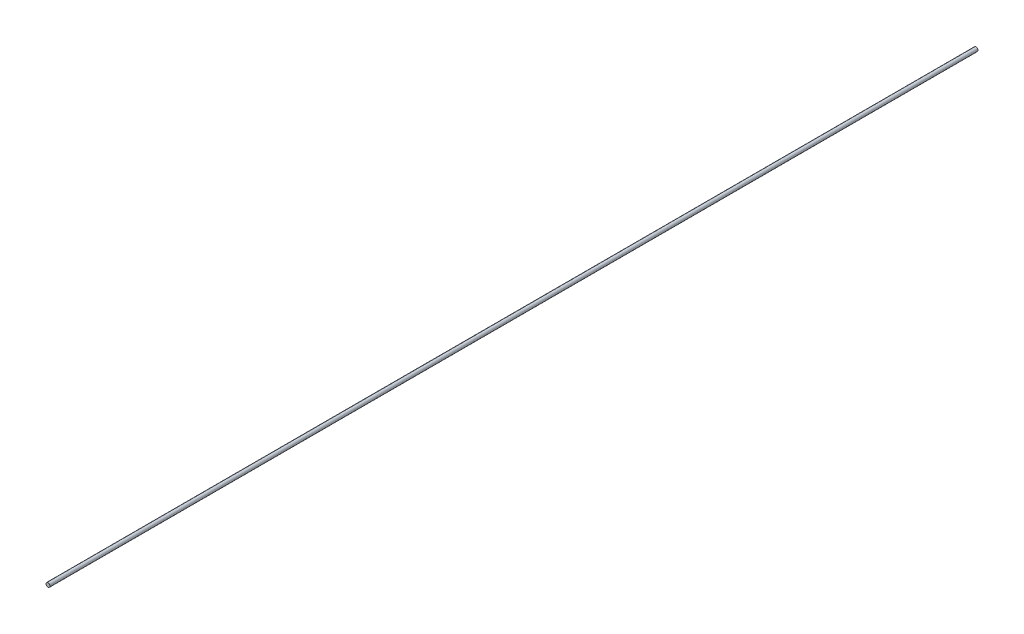
ISO-10303-21;
HEADER;
FILE_DESCRIPTION(('STEP AP214'),'2;1');
FILE_NAME('part.step','',(''),(''),'','','');
FILE_SCHEMA(('AUTOMOTIVE_DESIGN { 1 0 10303 214 1 1 1 1 }'));
ENDSEC;
DATA;
#1=APPLICATION_CONTEXT('core data for automotive mechanical design processes');
#2=APPLICATION_PROTOCOL_DEFINITION('international standard','automotive_design',2000,#1);
#3=PRODUCT_CONTEXT('',#1,'mechanical');
#4=PRODUCT('Part','Part','',(#3));
#5=PRODUCT_RELATED_PRODUCT_CATEGORY('part','',(#4));
#6=PRODUCT_DEFINITION_FORMATION('','',#4);
#7=PRODUCT_DEFINITION_CONTEXT('part definition',#1,'design');
#8=PRODUCT_DEFINITION('design','',#6,#7);
#9=PRODUCT_DEFINITION_SHAPE('','',#8);
#10=(LENGTH_UNIT() NAMED_UNIT(*) SI_UNIT(.MILLI.,.METRE.));
#11=(NAMED_UNIT(*) PLANE_ANGLE_UNIT() SI_UNIT($,.RADIAN.));
#12=(NAMED_UNIT(*) SI_UNIT($,.STERADIAN.) SOLID_ANGLE_UNIT());
#13=UNCERTAINTY_MEASURE_WITH_UNIT(LENGTH_MEASURE(1.E-05),#10,'distance_accuracy_value','');
#14=(GEOMETRIC_REPRESENTATION_CONTEXT(3) GLOBAL_UNCERTAINTY_ASSIGNED_CONTEXT((#13)) GLOBAL_UNIT_ASSIGNED_CONTEXT((#10,
#11,#12)) REPRESENTATION_CONTEXT('',''));
#15=CARTESIAN_POINT('',(0.,0.,0.));
#16=DIRECTION('',(0.,0.,1.));
#17=DIRECTION('',(1.,0.,0.));
#18=AXIS2_PLACEMENT_3D('',#15,#16,#17);
#19=CARTESIAN_POINT('',(0.,0.,360.));
#20=DIRECTION('',(0.,0.,-1.));
#21=DIRECTION('',(-1.,0.,0.));
#22=AXIS2_PLACEMENT_3D('',#19,#20,#21);
#23=CYLINDRICAL_SURFACE('',#22,1.55);
#24=CARTESIAN_POINT('',(0.,0.,360.));
#25=DIRECTION('',(0.,0.,1.));
#26=DIRECTION('',(1.,0.,0.));
#27=AXIS2_PLACEMENT_3D('',#24,#25,#26);
#28=CIRCLE('',#27,1.55);
#29=CARTESIAN_POINT('',(1.55,0.,360.));
#30=VERTEX_POINT('',#29);
#31=EDGE_CURVE('E10',#30,#30,#28,.T.);
#32=ORIENTED_EDGE('',*,*,#31,.F.);
#33=EDGE_LOOP('',(#32));
#34=FACE_BOUND('',#33,.T.);
#35=CARTESIAN_POINT('',(0.,0.,-360.));
#36=DIRECTION('',(0.,0.,1.));
#37=DIRECTION('',(1.,0.,0.));
#38=AXIS2_PLACEMENT_3D('',#35,#36,#37);
#39=CIRCLE('',#38,1.55);
#40=CARTESIAN_POINT('',(1.55,0.,-360.));
#41=VERTEX_POINT('',#40);
#42=EDGE_CURVE('E36',#41,#41,#39,.T.);
#43=ORIENTED_EDGE('',*,*,#42,.T.);
#44=EDGE_LOOP('',(#43));
#45=FACE_BOUND('',#44,.T.);
#46=ADVANCED_FACE('F33',(#34,#45),#23,.T.);
#47=CARTESIAN_POINT('',(0.,0.,360.));
#48=DIRECTION('',(0.,0.,1.));
#49=DIRECTION('',(1.,0.,0.));
#50=AXIS2_PLACEMENT_3D('',#47,#48,#49);
#51=PLANE('',#50);
#52=ORIENTED_EDGE('',*,*,#31,.T.);
#53=EDGE_LOOP('',(#52));
#54=FACE_BOUND('',#53,.T.);
#55=ADVANCED_FACE('F48',(#54),#51,.T.);
#56=CARTESIAN_POINT('',(0.,0.,-360.));
#57=DIRECTION('',(0.,0.,1.));
#58=DIRECTION('',(1.,0.,0.));
#59=AXIS2_PLACEMENT_3D('',#56,#57,#58);
#60=PLANE('',#59);
#61=ORIENTED_EDGE('',*,*,#42,.F.);
#62=EDGE_LOOP('',(#61));
#63=FACE_BOUND('',#62,.T.);
#64=ADVANCED_FACE('F46',(#63),#60,.F.);
#65=CLOSED_SHELL('',(#46,#55,#64));
#66=MANIFOLD_SOLID_BREP('B2',#65);
#67=ADVANCED_BREP_SHAPE_REPRESENTATION('',(#18,#66),#14);
#68=SHAPE_DEFINITION_REPRESENTATION(#9,#67);
ENDSEC;
END-ISO-10303-21;
